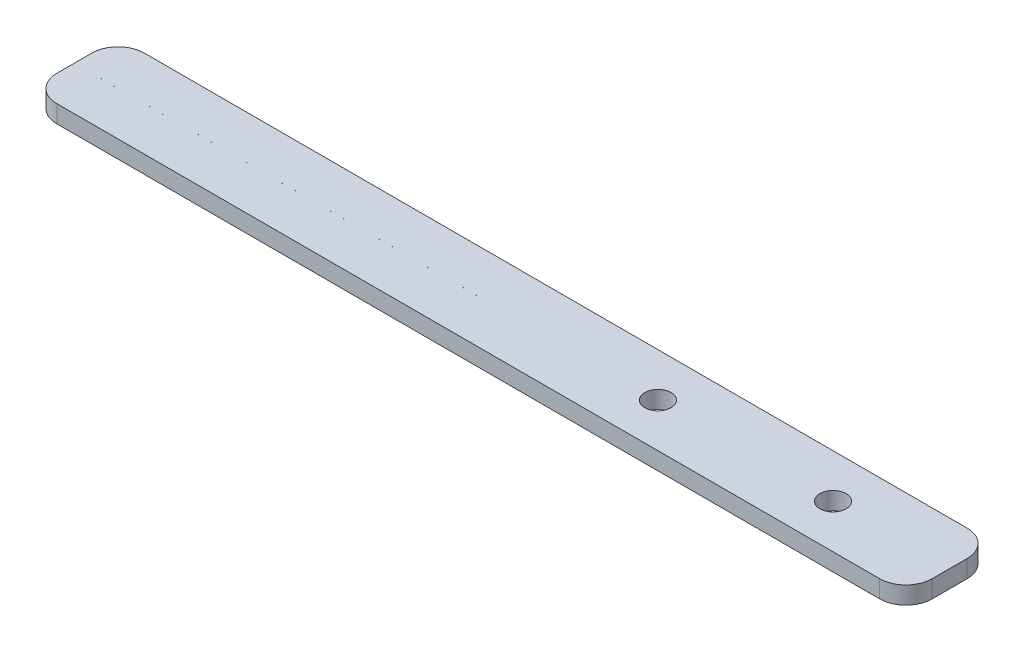
ISO-10303-21;
HEADER;
FILE_DESCRIPTION(('STEP AP214'),'2;1');
FILE_NAME('part.step','',(''),(''),'','','');
FILE_SCHEMA(('AUTOMOTIVE_DESIGN { 1 0 10303 214 1 1 1 1 }'));
ENDSEC;
DATA;
#1=APPLICATION_CONTEXT('core data for automotive mechanical design processes');
#2=APPLICATION_PROTOCOL_DEFINITION('international standard','automotive_design',2000,#1);
#3=PRODUCT_CONTEXT('',#1,'mechanical');
#4=PRODUCT('Part','Part','',(#3));
#5=PRODUCT_RELATED_PRODUCT_CATEGORY('part','',(#4));
#6=PRODUCT_DEFINITION_FORMATION('','',#4);
#7=PRODUCT_DEFINITION_CONTEXT('part definition',#1,'design');
#8=PRODUCT_DEFINITION('design','',#6,#7);
#9=PRODUCT_DEFINITION_SHAPE('','',#8);
#10=(LENGTH_UNIT() NAMED_UNIT(*) SI_UNIT(.MILLI.,.METRE.));
#11=(NAMED_UNIT(*) PLANE_ANGLE_UNIT() SI_UNIT($,.RADIAN.));
#12=(NAMED_UNIT(*) SI_UNIT($,.STERADIAN.) SOLID_ANGLE_UNIT());
#13=UNCERTAINTY_MEASURE_WITH_UNIT(LENGTH_MEASURE(1.E-05),#10,'distance_accuracy_value','');
#14=(GEOMETRIC_REPRESENTATION_CONTEXT(3) GLOBAL_UNCERTAINTY_ASSIGNED_CONTEXT((#13)) GLOBAL_UNIT_ASSIGNED_CONTEXT((#10,
#11,#12)) REPRESENTATION_CONTEXT('',''));
#15=CARTESIAN_POINT('',(0.,0.,0.));
#16=DIRECTION('',(0.,0.,1.));
#17=DIRECTION('',(1.,0.,0.));
#18=AXIS2_PLACEMENT_3D('',#15,#16,#17);
#19=CARTESIAN_POINT('',(-49.9999999999999,2.,-5.));
#20=DIRECTION('',(1.,0.,0.));
#21=DIRECTION('',(0.,0.,-1.));
#22=AXIS2_PLACEMENT_3D('',#19,#20,#21);
#23=PLANE('',#22);
#24=DIRECTION('',(0.,0.,1.));
#25=VECTOR('',#24,1.);
#26=CARTESIAN_POINT('',(-49.9999999999999,0.,-5.));
#27=LINE('',#26,#25);
#28=CARTESIAN_POINT('',(-49.9999999999999,0.,-2.));
#29=VERTEX_POINT('',#28);
#30=CARTESIAN_POINT('',(-49.9999999999999,0.,-0.000499999999997139));
#31=VERTEX_POINT('',#30);
#32=EDGE_CURVE('E166',#29,#31,#27,.T.);
#33=ORIENTED_EDGE('',*,*,#32,.T.);
#34=DIRECTION('',(0.,1.,0.));
#35=VECTOR('',#34,1.);
#36=CARTESIAN_POINT('',(-49.9999999999999,-8.,-0.000499999999997139));
#37=LINE('',#36,#35);
#38=CARTESIAN_POINT('',(-49.9999999999999,2.,-0.000499999999997139));
#39=VERTEX_POINT('',#38);
#40=EDGE_CURVE('E215',#31,#39,#37,.T.);
#41=ORIENTED_EDGE('',*,*,#40,.T.);
#42=DIRECTION('',(0.,0.,1.));
#43=VECTOR('',#42,1.);
#44=CARTESIAN_POINT('',(-49.9999999999999,2.,-5.));
#45=LINE('',#44,#43);
#46=CARTESIAN_POINT('',(-49.9999999999999,2.,-2.));
#47=VERTEX_POINT('',#46);
#48=EDGE_CURVE('E147',#47,#39,#45,.T.);
#49=ORIENTED_EDGE('',*,*,#48,.F.);
#50=DIRECTION('',(0.,-1.,0.));
#51=VECTOR('',#50,1.);
#52=CARTESIAN_POINT('',(-49.9999999999999,2.,-2.));
#53=LINE('',#52,#51);
#54=EDGE_CURVE('E172',#47,#29,#53,.T.);
#55=ORIENTED_EDGE('',*,*,#54,.T.);
#56=EDGE_LOOP('',(#33,#41,#49,#55));
#57=FACE_BOUND('',#56,.T.);
#58=ADVANCED_FACE('F33',(#57),#23,.F.);
#59=CARTESIAN_POINT('',(50.0000000000001,2.,-5.));
#60=DIRECTION('',(-1.,0.,0.));
#61=DIRECTION('',(0.,0.,1.));
#62=AXIS2_PLACEMENT_3D('',#59,#60,#61);
#63=PLANE('',#62);
#64=DIRECTION('',(0.,0.,-1.));
#65=VECTOR('',#64,1.);
#66=CARTESIAN_POINT('',(50.0000000000001,2.,-5.));
#67=LINE('',#66,#65);
#68=CARTESIAN_POINT('',(50.0000000000001,2.,2.));
#69=VERTEX_POINT('',#68);
#70=CARTESIAN_POINT('',(50.0000000000001,2.,-2.));
#71=VERTEX_POINT('',#70);
#72=EDGE_CURVE('E153',#69,#71,#67,.T.);
#73=ORIENTED_EDGE('',*,*,#72,.F.);
#74=DIRECTION('',(0.,-1.,0.));
#75=VECTOR('',#74,1.);
#76=CARTESIAN_POINT('',(50.0000000000001,2.,2.));
#77=LINE('',#76,#75);
#78=CARTESIAN_POINT('',(50.0000000000001,0.,2.));
#79=VERTEX_POINT('',#78);
#80=EDGE_CURVE('E203',#69,#79,#77,.T.);
#81=ORIENTED_EDGE('',*,*,#80,.T.);
#82=DIRECTION('',(0.,0.,-1.));
#83=VECTOR('',#82,1.);
#84=CARTESIAN_POINT('',(50.0000000000001,0.,-5.));
#85=LINE('',#84,#83);
#86=CARTESIAN_POINT('',(50.0000000000001,0.,-2.));
#87=VERTEX_POINT('',#86);
#88=EDGE_CURVE('E158',#79,#87,#85,.T.);
#89=ORIENTED_EDGE('',*,*,#88,.T.);
#90=DIRECTION('',(0.,-1.,0.));
#91=VECTOR('',#90,1.);
#92=CARTESIAN_POINT('',(50.0000000000001,2.,-2.));
#93=LINE('',#92,#91);
#94=EDGE_CURVE('E201',#87,#71,#93,.F.);
#95=ORIENTED_EDGE('',*,*,#94,.T.);
#96=EDGE_LOOP('',(#73,#81,#89,#95));
#97=FACE_BOUND('',#96,.T.);
#98=ADVANCED_FACE('F267',(#97),#63,.F.);
#99=CARTESIAN_POINT('',(-49.9999999999999,2.,-5.));
#100=DIRECTION('',(0.,0.,1.));
#101=DIRECTION('',(1.,0.,0.));
#102=AXIS2_PLACEMENT_3D('',#99,#100,#101);
#103=PLANE('',#102);
#104=DIRECTION('',(-1.,0.,0.));
#105=VECTOR('',#104,1.);
#106=CARTESIAN_POINT('',(-49.9999999999999,0.,-5.));
#107=LINE('',#106,#105);
#108=CARTESIAN_POINT('',(47.0000000000001,0.,-5.));
#109=VERTEX_POINT('',#108);
#110=CARTESIAN_POINT('',(-46.9999999999999,0.,-5.));
#111=VERTEX_POINT('',#110);
#112=EDGE_CURVE('E161',#109,#111,#107,.T.);
#113=ORIENTED_EDGE('',*,*,#112,.T.);
#114=DIRECTION('',(0.,-1.,0.));
#115=VECTOR('',#114,1.);
#116=CARTESIAN_POINT('',(-46.9999999999999,2.,-5.));
#117=LINE('',#116,#115);
#118=CARTESIAN_POINT('',(-46.9999999999999,2.,-5.));
#119=VERTEX_POINT('',#118);
#120=EDGE_CURVE('E187',#111,#119,#117,.F.);
#121=ORIENTED_EDGE('',*,*,#120,.T.);
#122=DIRECTION('',(-1.,0.,0.));
#123=VECTOR('',#122,1.);
#124=CARTESIAN_POINT('',(-49.9999999999999,2.,-5.));
#125=LINE('',#124,#123);
#126=CARTESIAN_POINT('',(47.0000000000001,2.,-5.));
#127=VERTEX_POINT('',#126);
#128=EDGE_CURVE('E148',#127,#119,#125,.T.);
#129=ORIENTED_EDGE('',*,*,#128,.F.);
#130=DIRECTION('',(0.,-1.,0.));
#131=VECTOR('',#130,1.);
#132=CARTESIAN_POINT('',(47.0000000000001,2.,-5.));
#133=LINE('',#132,#131);
#134=EDGE_CURVE('E184',#127,#109,#133,.T.);
#135=ORIENTED_EDGE('',*,*,#134,.T.);
#136=EDGE_LOOP('',(#113,#121,#129,#135));
#137=FACE_BOUND('',#136,.T.);
#138=ADVANCED_FACE('F244',(#137),#103,.F.);
#139=CARTESIAN_POINT('',(-49.9999999999999,2.,0.000500000000002885));
#140=VERTEX_POINT('',#139);
#141=CARTESIAN_POINT('',(-49.9999999999999,2.,2.));
#142=VERTEX_POINT('',#141);
#143=EDGE_CURVE('E138',#140,#142,#45,.T.);
#144=ORIENTED_EDGE('',*,*,#143,.F.);
#145=DIRECTION('',(0.,1.,0.));
#146=VECTOR('',#145,1.);
#147=CARTESIAN_POINT('',(-49.9999999999999,-8.,0.000500000000002885));
#148=LINE('',#147,#146);
#149=CARTESIAN_POINT('',(-49.9999999999999,0.,0.000500000000002885));
#150=VERTEX_POINT('',#149);
#151=EDGE_CURVE('E122',#150,#140,#148,.T.);
#152=ORIENTED_EDGE('',*,*,#151,.F.);
#153=CARTESIAN_POINT('',(-49.9999999999999,0.,2.));
#154=VERTEX_POINT('',#153);
#155=EDGE_CURVE('E165',#150,#154,#27,.T.);
#156=ORIENTED_EDGE('',*,*,#155,.T.);
#157=DIRECTION('',(0.,-1.,0.));
#158=VECTOR('',#157,1.);
#159=CARTESIAN_POINT('',(-49.9999999999999,2.,2.));
#160=LINE('',#159,#158);
#161=EDGE_CURVE('E145',#154,#142,#160,.F.);
#162=ORIENTED_EDGE('',*,*,#161,.T.);
#163=EDGE_LOOP('',(#144,#152,#156,#162));
#164=FACE_BOUND('',#163,.T.);
#165=ADVANCED_FACE('F143',(#164),#23,.F.);
#166=CARTESIAN_POINT('',(-49.9999999999999,2.,5.));
#167=DIRECTION('',(0.,0.,-1.));
#168=DIRECTION('',(-1.,0.,0.));
#169=AXIS2_PLACEMENT_3D('',#166,#167,#168);
#170=PLANE('',#169);
#171=DIRECTION('',(1.,0.,0.));
#172=VECTOR('',#171,1.);
#173=CARTESIAN_POINT('',(-49.9999999999999,2.,5.));
#174=LINE('',#173,#172);
#175=CARTESIAN_POINT('',(-46.9999999999999,2.,5.));
#176=VERTEX_POINT('',#175);
#177=CARTESIAN_POINT('',(47.0000000000001,2.,5.));
#178=VERTEX_POINT('',#177);
#179=EDGE_CURVE('E151',#176,#178,#174,.T.);
#180=ORIENTED_EDGE('',*,*,#179,.F.);
#181=DIRECTION('',(0.,-1.,0.));
#182=VECTOR('',#181,1.);
#183=CARTESIAN_POINT('',(-46.9999999999999,2.,5.));
#184=LINE('',#183,#182);
#185=CARTESIAN_POINT('',(-46.9999999999999,0.,5.));
#186=VERTEX_POINT('',#185);
#187=EDGE_CURVE('E198',#176,#186,#184,.T.);
#188=ORIENTED_EDGE('',*,*,#187,.T.);
#189=DIRECTION('',(1.,0.,0.));
#190=VECTOR('',#189,1.);
#191=CARTESIAN_POINT('',(-49.9999999999999,0.,5.));
#192=LINE('',#191,#190);
#193=CARTESIAN_POINT('',(47.0000000000001,0.,5.));
#194=VERTEX_POINT('',#193);
#195=EDGE_CURVE('E169',#186,#194,#192,.T.);
#196=ORIENTED_EDGE('',*,*,#195,.T.);
#197=DIRECTION('',(0.,-1.,0.));
#198=VECTOR('',#197,1.);
#199=CARTESIAN_POINT('',(47.0000000000001,2.,5.));
#200=LINE('',#199,#198);
#201=EDGE_CURVE('E56',#194,#178,#200,.F.);
#202=ORIENTED_EDGE('',*,*,#201,.T.);
#203=EDGE_LOOP('',(#180,#188,#196,#202));
#204=FACE_BOUND('',#203,.T.);
#205=ADVANCED_FACE('F276',(#204),#170,.F.);
#206=CARTESIAN_POINT('',(0.,2.,0.));
#207=DIRECTION('',(0.,1.,0.));
#208=DIRECTION('',(0.,0.,1.));
#209=AXIS2_PLACEMENT_3D('',#206,#207,#208);
#210=PLANE('',#209);
#211=DIRECTION('',(-1.,0.,0.));
#212=VECTOR('',#211,1.);
#213=CARTESIAN_POINT('',(-2.99999999999994,2.,-0.000500000000002885));
#214=LINE('',#213,#212);
#215=CARTESIAN_POINT('',(-2.99999999999994,2.,-0.000500000000002885));
#216=VERTEX_POINT('',#215);
#217=EDGE_CURVE('E132',#216,#39,#214,.T.);
#218=ORIENTED_EDGE('',*,*,#217,.F.);
#219=DIRECTION('',(4.33680868994191E-13,0.,-1.));
#220=VECTOR('',#219,1.);
#221=CARTESIAN_POINT('',(-2.99999999999994,2.,-0.000500000000002885));
#222=LINE('',#221,#220);
#223=CARTESIAN_POINT('',(-2.99999999999994,2.,0.000499999999997139));
#224=VERTEX_POINT('',#223);
#225=EDGE_CURVE('E141',#224,#216,#222,.T.);
#226=ORIENTED_EDGE('',*,*,#225,.F.);
#227=DIRECTION('',(1.,0.,0.));
#228=VECTOR('',#227,1.);
#229=CARTESIAN_POINT('',(-2.99999999999994,2.,0.000499999999997139));
#230=LINE('',#229,#228);
#231=EDGE_CURVE('E125',#140,#224,#230,.T.);
#232=ORIENTED_EDGE('',*,*,#231,.F.);
#233=ORIENTED_EDGE('',*,*,#143,.T.);
#234=CARTESIAN_POINT('',(-46.9999999999999,2.,2.));
#235=DIRECTION('',(0.,1.,0.));
#236=DIRECTION('',(0.,0.,1.));
#237=AXIS2_PLACEMENT_3D('',#234,#235,#236);
#238=CIRCLE('',#237,3.);
#239=EDGE_CURVE('E193',#142,#176,#238,.T.);
#240=ORIENTED_EDGE('',*,*,#239,.T.);
#241=ORIENTED_EDGE('',*,*,#179,.T.);
#242=CARTESIAN_POINT('',(47.0000000000001,2.,2.));
#243=DIRECTION('',(0.,1.,0.));
#244=DIRECTION('',(0.,0.,1.));
#245=AXIS2_PLACEMENT_3D('',#242,#243,#244);
#246=CIRCLE('',#245,3.);
#247=EDGE_CURVE('E191',#178,#69,#246,.T.);
#248=ORIENTED_EDGE('',*,*,#247,.T.);
#249=ORIENTED_EDGE('',*,*,#72,.T.);
#250=CARTESIAN_POINT('',(47.0000000000001,2.,-2.));
#251=DIRECTION('',(0.,1.,0.));
#252=DIRECTION('',(0.,0.,1.));
#253=AXIS2_PLACEMENT_3D('',#250,#251,#252);
#254=CIRCLE('',#253,3.);
#255=EDGE_CURVE('E189',#71,#127,#254,.T.);
#256=ORIENTED_EDGE('',*,*,#255,.T.);
#257=ORIENTED_EDGE('',*,*,#128,.T.);
#258=CARTESIAN_POINT('',(-46.9999999999999,2.,-2.));
#259=DIRECTION('',(0.,1.,0.));
#260=DIRECTION('',(0.,0.,1.));
#261=AXIS2_PLACEMENT_3D('',#258,#259,#260);
#262=CIRCLE('',#261,3.);
#263=EDGE_CURVE('E195',#119,#47,#262,.T.);
#264=ORIENTED_EDGE('',*,*,#263,.T.);
#265=ORIENTED_EDGE('',*,*,#48,.T.);
#266=EDGE_LOOP('',(#218,#226,#232,#233,#240,#241,#248,#249,#256,#257,#264,#265));
#267=FACE_BOUND('',#266,.T.);
#268=CARTESIAN_POINT('',(36.6694679551753,2.,0.));
#269=DIRECTION('',(0.,1.,0.));
#270=DIRECTION('',(0.,0.,1.));
#271=AXIS2_PLACEMENT_3D('',#268,#269,#270);
#272=CIRCLE('',#271,1.5);
#273=CARTESIAN_POINT('',(36.6694679551753,2.,1.5));
#274=VERTEX_POINT('',#273);
#275=EDGE_CURVE('E218',#274,#274,#272,.T.);
#276=ORIENTED_EDGE('',*,*,#275,.F.);
#277=EDGE_LOOP('',(#276));
#278=FACE_BOUND('',#277,.T.);
#279=CARTESIAN_POINT('',(16.6694679551753,2.,0.));
#280=DIRECTION('',(0.,1.,0.));
#281=DIRECTION('',(0.,0.,1.));
#282=AXIS2_PLACEMENT_3D('',#279,#280,#281);
#283=CIRCLE('',#282,1.5);
#284=CARTESIAN_POINT('',(16.6694679551753,2.,1.5));
#285=VERTEX_POINT('',#284);
#286=EDGE_CURVE('E228',#285,#285,#283,.T.);
#287=ORIENTED_EDGE('',*,*,#286,.F.);
#288=EDGE_LOOP('',(#287));
#289=FACE_BOUND('',#288,.T.);
#290=ADVANCED_FACE('F136',(#267,#278,#289),#210,.T.);
#291=CARTESIAN_POINT('',(0.,0.,0.));
#292=DIRECTION('',(0.,1.,0.));
#293=DIRECTION('',(0.,0.,1.));
#294=AXIS2_PLACEMENT_3D('',#291,#292,#293);
#295=PLANE('',#294);
#296=CARTESIAN_POINT('',(36.6694679551753,0.,0.));
#297=DIRECTION('',(0.,1.,0.));
#298=DIRECTION('',(0.,0.,1.));
#299=AXIS2_PLACEMENT_3D('',#296,#297,#298);
#300=CIRCLE('',#299,1.5);
#301=CARTESIAN_POINT('',(36.6694679551753,0.,1.5));
#302=VERTEX_POINT('',#301);
#303=EDGE_CURVE('E225',#302,#302,#300,.T.);
#304=ORIENTED_EDGE('',*,*,#303,.T.);
#305=EDGE_LOOP('',(#304));
#306=FACE_BOUND('',#305,.T.);
#307=CARTESIAN_POINT('',(16.6694679551753,0.,0.));
#308=DIRECTION('',(0.,1.,0.));
#309=DIRECTION('',(0.,0.,1.));
#310=AXIS2_PLACEMENT_3D('',#307,#308,#309);
#311=CIRCLE('',#310,1.5);
#312=CARTESIAN_POINT('',(16.6694679551753,0.,1.5));
#313=VERTEX_POINT('',#312);
#314=EDGE_CURVE('E162',#313,#313,#311,.T.);
#315=ORIENTED_EDGE('',*,*,#314,.T.);
#316=EDGE_LOOP('',(#315));
#317=FACE_BOUND('',#316,.T.);
#318=DIRECTION('',(4.33680868994191E-13,0.,-1.));
#319=VECTOR('',#318,1.);
#320=CARTESIAN_POINT('',(-2.99999999999994,0.,-1.30104260698255E-12));
#321=LINE('',#320,#319);
#322=CARTESIAN_POINT('',(-2.99999999999994,0.,0.000499999999997139));
#323=VERTEX_POINT('',#322);
#324=CARTESIAN_POINT('',(-2.99999999999994,0.,-0.000500000000002885));
#325=VERTEX_POINT('',#324);
#326=EDGE_CURVE('E41',#323,#325,#321,.T.);
#327=ORIENTED_EDGE('',*,*,#326,.T.);
#328=DIRECTION('',(-1.,0.,0.));
#329=VECTOR('',#328,1.);
#330=CARTESIAN_POINT('',(0.,0.,-0.000500000000003252));
#331=LINE('',#330,#329);
#332=EDGE_CURVE('E11',#325,#31,#331,.T.);
#333=ORIENTED_EDGE('',*,*,#332,.T.);
#334=ORIENTED_EDGE('',*,*,#32,.F.);
#335=CARTESIAN_POINT('',(-46.9999999999999,0.,-2.));
#336=DIRECTION('',(0.,1.,0.));
#337=DIRECTION('',(0.,0.,1.));
#338=AXIS2_PLACEMENT_3D('',#335,#336,#337);
#339=CIRCLE('',#338,3.);
#340=EDGE_CURVE('E182',#29,#111,#339,.F.);
#341=ORIENTED_EDGE('',*,*,#340,.T.);
#342=ORIENTED_EDGE('',*,*,#112,.F.);
#343=CARTESIAN_POINT('',(47.0000000000001,0.,-2.));
#344=DIRECTION('',(0.,1.,0.));
#345=DIRECTION('',(0.,0.,1.));
#346=AXIS2_PLACEMENT_3D('',#343,#344,#345);
#347=CIRCLE('',#346,3.);
#348=EDGE_CURVE('E175',#109,#87,#347,.F.);
#349=ORIENTED_EDGE('',*,*,#348,.T.);
#350=ORIENTED_EDGE('',*,*,#88,.F.);
#351=CARTESIAN_POINT('',(47.0000000000001,0.,2.));
#352=DIRECTION('',(0.,1.,0.));
#353=DIRECTION('',(0.,0.,1.));
#354=AXIS2_PLACEMENT_3D('',#351,#352,#353);
#355=CIRCLE('',#354,3.);
#356=EDGE_CURVE('E177',#79,#194,#355,.F.);
#357=ORIENTED_EDGE('',*,*,#356,.T.);
#358=ORIENTED_EDGE('',*,*,#195,.F.);
#359=CARTESIAN_POINT('',(-46.9999999999999,0.,2.));
#360=DIRECTION('',(0.,1.,0.));
#361=DIRECTION('',(0.,0.,1.));
#362=AXIS2_PLACEMENT_3D('',#359,#360,#361);
#363=CIRCLE('',#362,3.);
#364=EDGE_CURVE('E179',#186,#154,#363,.F.);
#365=ORIENTED_EDGE('',*,*,#364,.T.);
#366=ORIENTED_EDGE('',*,*,#155,.F.);
#367=DIRECTION('',(1.,0.,0.));
#368=VECTOR('',#367,1.);
#369=CARTESIAN_POINT('',(0.,0.,0.000499999999996772));
#370=LINE('',#369,#368);
#371=EDGE_CURVE('E128',#150,#323,#370,.T.);
#372=ORIENTED_EDGE('',*,*,#371,.T.);
#373=EDGE_LOOP('',(#327,#333,#334,#341,#342,#349,#350,#357,#358,#365,#366,#372));
#374=FACE_BOUND('',#373,.T.);
#375=ADVANCED_FACE('F208',(#306,#317,#374),#295,.F.);
#376=CARTESIAN_POINT('',(-46.9999999999999,2.,-2.));
#377=DIRECTION('',(0.,-1.,0.));
#378=DIRECTION('',(0.,0.,-1.));
#379=AXIS2_PLACEMENT_3D('',#376,#377,#378);
#380=CYLINDRICAL_SURFACE('',#379,3.);
#381=ORIENTED_EDGE('',*,*,#263,.F.);
#382=ORIENTED_EDGE('',*,*,#120,.F.);
#383=ORIENTED_EDGE('',*,*,#340,.F.);
#384=ORIENTED_EDGE('',*,*,#54,.F.);
#385=EDGE_LOOP('',(#381,#382,#383,#384));
#386=FACE_BOUND('',#385,.T.);
#387=ADVANCED_FACE('F250',(#386),#380,.T.);
#388=CARTESIAN_POINT('',(-46.9999999999999,2.,2.));
#389=DIRECTION('',(0.,-1.,0.));
#390=DIRECTION('',(0.,0.,-1.));
#391=AXIS2_PLACEMENT_3D('',#388,#389,#390);
#392=CYLINDRICAL_SURFACE('',#391,3.);
#393=ORIENTED_EDGE('',*,*,#239,.F.);
#394=ORIENTED_EDGE('',*,*,#161,.F.);
#395=ORIENTED_EDGE('',*,*,#364,.F.);
#396=ORIENTED_EDGE('',*,*,#187,.F.);
#397=EDGE_LOOP('',(#393,#394,#395,#396));
#398=FACE_BOUND('',#397,.T.);
#399=ADVANCED_FACE('F286',(#398),#392,.T.);
#400=CARTESIAN_POINT('',(47.0000000000001,2.,2.));
#401=DIRECTION('',(0.,-1.,0.));
#402=DIRECTION('',(0.,0.,-1.));
#403=AXIS2_PLACEMENT_3D('',#400,#401,#402);
#404=CYLINDRICAL_SURFACE('',#403,3.);
#405=ORIENTED_EDGE('',*,*,#247,.F.);
#406=ORIENTED_EDGE('',*,*,#201,.F.);
#407=ORIENTED_EDGE('',*,*,#356,.F.);
#408=ORIENTED_EDGE('',*,*,#80,.F.);
#409=EDGE_LOOP('',(#405,#406,#407,#408));
#410=FACE_BOUND('',#409,.T.);
#411=ADVANCED_FACE('F288',(#410),#404,.T.);
#412=CARTESIAN_POINT('',(47.0000000000001,2.,-2.));
#413=DIRECTION('',(0.,-1.,0.));
#414=DIRECTION('',(0.,0.,-1.));
#415=AXIS2_PLACEMENT_3D('',#412,#413,#414);
#416=CYLINDRICAL_SURFACE('',#415,3.);
#417=ORIENTED_EDGE('',*,*,#255,.F.);
#418=ORIENTED_EDGE('',*,*,#94,.F.);
#419=ORIENTED_EDGE('',*,*,#348,.F.);
#420=ORIENTED_EDGE('',*,*,#134,.F.);
#421=EDGE_LOOP('',(#417,#418,#419,#420));
#422=FACE_BOUND('',#421,.T.);
#423=ADVANCED_FACE('F35',(#422),#416,.T.);
#424=CARTESIAN_POINT('',(16.6694679551753,2.,0.));
#425=DIRECTION('',(0.,1.,0.));
#426=DIRECTION('',(0.,0.,1.));
#427=AXIS2_PLACEMENT_3D('',#424,#425,#426);
#428=CYLINDRICAL_SURFACE('',#427,1.5);
#429=ORIENTED_EDGE('',*,*,#314,.F.);
#430=EDGE_LOOP('',(#429));
#431=FACE_BOUND('',#430,.T.);
#432=ORIENTED_EDGE('',*,*,#286,.T.);
#433=EDGE_LOOP('',(#432));
#434=FACE_BOUND('',#433,.T.);
#435=ADVANCED_FACE('F263',(#431,#434),#428,.F.);
#436=CARTESIAN_POINT('',(36.6694679551753,2.,0.));
#437=DIRECTION('',(0.,1.,0.));
#438=DIRECTION('',(0.,0.,1.));
#439=AXIS2_PLACEMENT_3D('',#436,#437,#438);
#440=CYLINDRICAL_SURFACE('',#439,1.5);
#441=ORIENTED_EDGE('',*,*,#303,.F.);
#442=EDGE_LOOP('',(#441));
#443=FACE_BOUND('',#442,.T.);
#444=ORIENTED_EDGE('',*,*,#275,.T.);
#445=EDGE_LOOP('',(#444));
#446=FACE_BOUND('',#445,.T.);
#447=ADVANCED_FACE('F256',(#443,#446),#440,.F.);
#448=CARTESIAN_POINT('',(-2.99999999999994,-8.,-0.000500000000002885));
#449=DIRECTION('',(0.,0.,-1.));
#450=DIRECTION('',(-1.,0.,0.));
#451=AXIS2_PLACEMENT_3D('',#448,#449,#450);
#452=PLANE('',#451);
#453=DIRECTION('',(0.,1.,0.));
#454=VECTOR('',#453,1.);
#455=CARTESIAN_POINT('',(-2.99999999999994,-8.,-0.000500000000002885));
#456=LINE('',#455,#454);
#457=EDGE_CURVE('E213',#325,#216,#456,.T.);
#458=ORIENTED_EDGE('',*,*,#457,.T.);
#459=ORIENTED_EDGE('',*,*,#217,.T.);
#460=ORIENTED_EDGE('',*,*,#40,.F.);
#461=ORIENTED_EDGE('',*,*,#332,.F.);
#462=EDGE_LOOP('',(#458,#459,#460,#461));
#463=FACE_BOUND('',#462,.T.);
#464=ADVANCED_FACE('F254',(#463),#452,.F.);
#465=CARTESIAN_POINT('',(-2.99999999999994,-8.,-0.000500000000002885));
#466=DIRECTION('',(1.,0.,4.33680868994191E-13));
#467=DIRECTION('',(4.33680868994191E-13,0.,-1.));
#468=AXIS2_PLACEMENT_3D('',#465,#466,#467);
#469=PLANE('',#468);
#470=DIRECTION('',(0.,1.,0.));
#471=VECTOR('',#470,1.);
#472=CARTESIAN_POINT('',(-2.99999999999994,-8.,0.000499999999997139));
#473=LINE('',#472,#471);
#474=EDGE_CURVE('E48',#323,#224,#473,.T.);
#475=ORIENTED_EDGE('',*,*,#474,.T.);
#476=ORIENTED_EDGE('',*,*,#225,.T.);
#477=ORIENTED_EDGE('',*,*,#457,.F.);
#478=ORIENTED_EDGE('',*,*,#326,.F.);
#479=EDGE_LOOP('',(#475,#476,#477,#478));
#480=FACE_BOUND('',#479,.T.);
#481=ADVANCED_FACE('F212',(#480),#469,.F.);
#482=CARTESIAN_POINT('',(-2.99999999999994,-8.,0.000499999999997139));
#483=DIRECTION('',(0.,0.,1.));
#484=DIRECTION('',(1.,0.,0.));
#485=AXIS2_PLACEMENT_3D('',#482,#483,#484);
#486=PLANE('',#485);
#487=ORIENTED_EDGE('',*,*,#151,.T.);
#488=ORIENTED_EDGE('',*,*,#231,.T.);
#489=ORIENTED_EDGE('',*,*,#474,.F.);
#490=ORIENTED_EDGE('',*,*,#371,.F.);
#491=EDGE_LOOP('',(#487,#488,#489,#490));
#492=FACE_BOUND('',#491,.T.);
#493=ADVANCED_FACE('F124',(#492),#486,.F.);
#494=CLOSED_SHELL('',(#58,#98,#138,#165,#205,#290,#375,#387,#399,#411,#423,#435,#447,#464,#481,#493));
#495=MANIFOLD_SOLID_BREP('B2',#494);
#496=ADVANCED_BREP_SHAPE_REPRESENTATION('',(#18,#495),#14);
#497=SHAPE_DEFINITION_REPRESENTATION(#9,#496);
ENDSEC;
END-ISO-10303-21;
